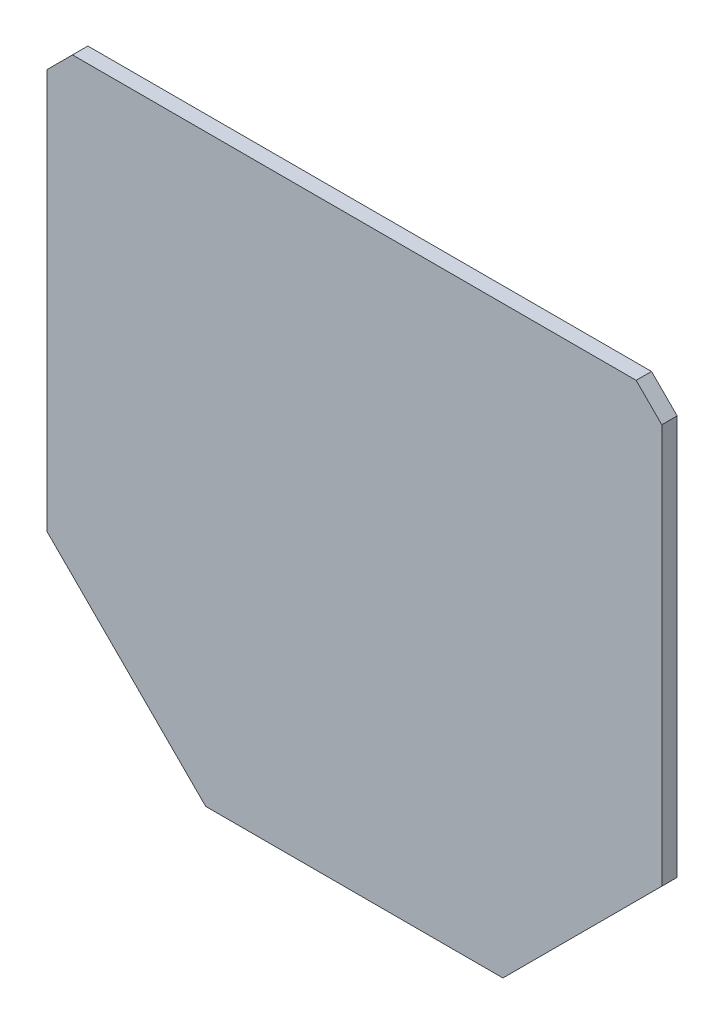
ISO-10303-21;
HEADER;
FILE_DESCRIPTION(('STEP AP214'),'2;1');
FILE_NAME('part.step','',(''),(''),'','','');
FILE_SCHEMA(('AUTOMOTIVE_DESIGN { 1 0 10303 214 1 1 1 1 }'));
ENDSEC;
DATA;
#1=APPLICATION_CONTEXT('core data for automotive mechanical design processes');
#2=APPLICATION_PROTOCOL_DEFINITION('international standard','automotive_design',2000,#1);
#3=PRODUCT_CONTEXT('',#1,'mechanical');
#4=PRODUCT('Part','Part','',(#3));
#5=PRODUCT_RELATED_PRODUCT_CATEGORY('part','',(#4));
#6=PRODUCT_DEFINITION_FORMATION('','',#4);
#7=PRODUCT_DEFINITION_CONTEXT('part definition',#1,'design');
#8=PRODUCT_DEFINITION('design','',#6,#7);
#9=PRODUCT_DEFINITION_SHAPE('','',#8);
#10=(LENGTH_UNIT() NAMED_UNIT(*) SI_UNIT(.MILLI.,.METRE.));
#11=(NAMED_UNIT(*) PLANE_ANGLE_UNIT() SI_UNIT($,.RADIAN.));
#12=(NAMED_UNIT(*) SI_UNIT($,.STERADIAN.) SOLID_ANGLE_UNIT());
#13=UNCERTAINTY_MEASURE_WITH_UNIT(LENGTH_MEASURE(1.E-05),#10,'distance_accuracy_value','');
#14=(GEOMETRIC_REPRESENTATION_CONTEXT(3) GLOBAL_UNCERTAINTY_ASSIGNED_CONTEXT((#13)) GLOBAL_UNIT_ASSIGNED_CONTEXT((#10,
#11,#12)) REPRESENTATION_CONTEXT('',''));
#15=CARTESIAN_POINT('',(0.,0.,0.));
#16=DIRECTION('',(0.,0.,1.));
#17=DIRECTION('',(1.,0.,0.));
#18=AXIS2_PLACEMENT_3D('',#15,#16,#17);
#19=CARTESIAN_POINT('',(0.,22.,1.5));
#20=DIRECTION('',(0.,-1.,0.));
#21=DIRECTION('',(0.,0.,-1.));
#22=AXIS2_PLACEMENT_3D('',#19,#20,#21);
#23=PLANE('',#22);
#24=DIRECTION('',(-1.,0.,0.));
#25=VECTOR('',#24,1.);
#26=CARTESIAN_POINT('',(0.,22.,0.));
#27=LINE('',#26,#25);
#28=CARTESIAN_POINT('',(27.4974746830583,22.,0.));
#29=VERTEX_POINT('',#28);
#30=CARTESIAN_POINT('',(-27.4974746830583,22.,0.));
#31=VERTEX_POINT('',#30);
#32=EDGE_CURVE('E133',#29,#31,#27,.T.);
#33=ORIENTED_EDGE('',*,*,#32,.T.);
#34=DIRECTION('',(0.,0.,-1.));
#35=VECTOR('',#34,1.);
#36=CARTESIAN_POINT('',(-27.4974746830583,22.,1.5));
#37=LINE('',#36,#35);
#38=CARTESIAN_POINT('',(-27.4974746830583,22.,1.5));
#39=VERTEX_POINT('',#38);
#40=EDGE_CURVE('E11',#39,#31,#37,.T.);
#41=ORIENTED_EDGE('',*,*,#40,.F.);
#42=DIRECTION('',(-1.,0.,0.));
#43=VECTOR('',#42,1.);
#44=CARTESIAN_POINT('',(0.,22.,1.5));
#45=LINE('',#44,#43);
#46=CARTESIAN_POINT('',(27.4974746830583,22.,1.5));
#47=VERTEX_POINT('',#46);
#48=EDGE_CURVE('E152',#47,#39,#45,.T.);
#49=ORIENTED_EDGE('',*,*,#48,.F.);
#50=DIRECTION('',(0.,0.,-1.));
#51=VECTOR('',#50,1.);
#52=CARTESIAN_POINT('',(27.4974746830583,22.,1.5));
#53=LINE('',#52,#51);
#54=EDGE_CURVE('E129',#47,#29,#53,.T.);
#55=ORIENTED_EDGE('',*,*,#54,.T.);
#56=EDGE_LOOP('',(#33,#41,#49,#55));
#57=FACE_BOUND('',#56,.T.);
#58=ADVANCED_FACE('F39',(#57),#23,.F.);
#59=CARTESIAN_POINT('',(-24.7487373415291,24.7487373415292,1.5));
#60=DIRECTION('',(0.707106781186547,-0.707106781186548,0.));
#61=DIRECTION('',(0.707106781186548,0.707106781186547,0.));
#62=AXIS2_PLACEMENT_3D('',#59,#60,#61);
#63=PLANE('',#62);
#64=DIRECTION('',(-0.707106781186548,-0.707106781186547,0.));
#65=VECTOR('',#64,1.);
#66=CARTESIAN_POINT('',(-24.7487373415291,24.7487373415292,0.));
#67=LINE('',#66,#65);
#68=CARTESIAN_POINT('',(-30.,19.4974746830583,0.));
#69=VERTEX_POINT('',#68);
#70=EDGE_CURVE('E136',#31,#69,#67,.T.);
#71=ORIENTED_EDGE('',*,*,#70,.T.);
#72=DIRECTION('',(0.,0.,-1.));
#73=VECTOR('',#72,1.);
#74=CARTESIAN_POINT('',(-30.,19.4974746830583,1.5));
#75=LINE('',#74,#73);
#76=CARTESIAN_POINT('',(-30.,19.4974746830583,1.5));
#77=VERTEX_POINT('',#76);
#78=EDGE_CURVE('E47',#77,#69,#75,.T.);
#79=ORIENTED_EDGE('',*,*,#78,.F.);
#80=DIRECTION('',(-0.707106781186548,-0.707106781186547,0.));
#81=VECTOR('',#80,1.);
#82=CARTESIAN_POINT('',(-24.7487373415291,24.7487373415292,1.5));
#83=LINE('',#82,#81);
#84=EDGE_CURVE('E94',#39,#77,#83,.T.);
#85=ORIENTED_EDGE('',*,*,#84,.F.);
#86=ORIENTED_EDGE('',*,*,#40,.T.);
#87=EDGE_LOOP('',(#71,#79,#85,#86));
#88=FACE_BOUND('',#87,.T.);
#89=ADVANCED_FACE('F165',(#88),#63,.F.);
#90=CARTESIAN_POINT('',(-30.,0.,1.5));
#91=DIRECTION('',(-1.,0.,0.));
#92=DIRECTION('',(0.,0.,1.));
#93=AXIS2_PLACEMENT_3D('',#90,#91,#92);
#94=PLANE('',#93);
#95=DIRECTION('',(0.,1.,0.));
#96=VECTOR('',#95,1.);
#97=CARTESIAN_POINT('',(-30.,0.,0.));
#98=LINE('',#97,#96);
#99=CARTESIAN_POINT('',(-30.,-19.4974746830584,0.));
#100=VERTEX_POINT('',#99);
#101=EDGE_CURVE('E139',#100,#69,#98,.T.);
#102=ORIENTED_EDGE('',*,*,#101,.F.);
#103=DIRECTION('',(0.,0.,-1.));
#104=VECTOR('',#103,1.);
#105=CARTESIAN_POINT('',(-30.,-19.4974746830584,1.5));
#106=LINE('',#105,#104);
#107=CARTESIAN_POINT('',(-30.,-19.4974746830584,1.5));
#108=VERTEX_POINT('',#107);
#109=EDGE_CURVE('E158',#108,#100,#106,.T.);
#110=ORIENTED_EDGE('',*,*,#109,.F.);
#111=DIRECTION('',(0.,1.,0.));
#112=VECTOR('',#111,1.);
#113=CARTESIAN_POINT('',(-30.,0.,1.5));
#114=LINE('',#113,#112);
#115=EDGE_CURVE('E164',#108,#77,#114,.T.);
#116=ORIENTED_EDGE('',*,*,#115,.T.);
#117=ORIENTED_EDGE('',*,*,#78,.T.);
#118=EDGE_LOOP('',(#102,#110,#116,#117));
#119=FACE_BOUND('',#118,.T.);
#120=ADVANCED_FACE('F162',(#119),#94,.T.);
#121=CARTESIAN_POINT('',(-24.7487373415291,-24.7487373415292,1.5));
#122=DIRECTION('',(0.707106781186546,0.707106781186548,0.));
#123=DIRECTION('',(-0.707106781186549,0.707106781186546,0.));
#124=AXIS2_PLACEMENT_3D('',#121,#122,#123);
#125=PLANE('',#124);
#126=DIRECTION('',(0.707106781186549,-0.707106781186546,0.));
#127=VECTOR('',#126,1.);
#128=CARTESIAN_POINT('',(-24.7487373415291,-24.7487373415292,0.));
#129=LINE('',#128,#127);
#130=CARTESIAN_POINT('',(-14.4974746830583,-35.,0.));
#131=VERTEX_POINT('',#130);
#132=EDGE_CURVE('E142',#100,#131,#129,.T.);
#133=ORIENTED_EDGE('',*,*,#132,.T.);
#134=DIRECTION('',(0.,0.,-1.));
#135=VECTOR('',#134,1.);
#136=CARTESIAN_POINT('',(-14.4974746830583,-35.,1.5));
#137=LINE('',#136,#135);
#138=CARTESIAN_POINT('',(-14.4974746830583,-35.,1.5));
#139=VERTEX_POINT('',#138);
#140=EDGE_CURVE('E156',#139,#131,#137,.T.);
#141=ORIENTED_EDGE('',*,*,#140,.F.);
#142=DIRECTION('',(0.707106781186549,-0.707106781186546,0.));
#143=VECTOR('',#142,1.);
#144=CARTESIAN_POINT('',(-24.7487373415291,-24.7487373415292,1.5));
#145=LINE('',#144,#143);
#146=EDGE_CURVE('E176',#108,#139,#145,.T.);
#147=ORIENTED_EDGE('',*,*,#146,.F.);
#148=ORIENTED_EDGE('',*,*,#109,.T.);
#149=EDGE_LOOP('',(#133,#141,#147,#148));
#150=FACE_BOUND('',#149,.T.);
#151=ADVANCED_FACE('F174',(#150),#125,.F.);
#152=CARTESIAN_POINT('',(0.,-35.,1.5));
#153=DIRECTION('',(0.,-1.,0.));
#154=DIRECTION('',(1.,0.,0.));
#155=AXIS2_PLACEMENT_3D('',#152,#153,#154);
#156=PLANE('',#155);
#157=DIRECTION('',(-1.,0.,0.));
#158=VECTOR('',#157,1.);
#159=CARTESIAN_POINT('',(0.,-35.,0.));
#160=LINE('',#159,#158);
#161=CARTESIAN_POINT('',(14.4974746830583,-35.,0.));
#162=VERTEX_POINT('',#161);
#163=EDGE_CURVE('E145',#162,#131,#160,.T.);
#164=ORIENTED_EDGE('',*,*,#163,.F.);
#165=DIRECTION('',(0.,0.,-1.));
#166=VECTOR('',#165,1.);
#167=CARTESIAN_POINT('',(14.4974746830583,-35.,1.5));
#168=LINE('',#167,#166);
#169=CARTESIAN_POINT('',(14.4974746830583,-35.,1.5));
#170=VERTEX_POINT('',#169);
#171=EDGE_CURVE('E119',#170,#162,#168,.T.);
#172=ORIENTED_EDGE('',*,*,#171,.F.);
#173=DIRECTION('',(-1.,0.,0.));
#174=VECTOR('',#173,1.);
#175=CARTESIAN_POINT('',(0.,-35.,1.5));
#176=LINE('',#175,#174);
#177=EDGE_CURVE('E125',#170,#139,#176,.T.);
#178=ORIENTED_EDGE('',*,*,#177,.T.);
#179=ORIENTED_EDGE('',*,*,#140,.T.);
#180=EDGE_LOOP('',(#164,#172,#178,#179));
#181=FACE_BOUND('',#180,.T.);
#182=ADVANCED_FACE('F182',(#181),#156,.T.);
#183=CARTESIAN_POINT('',(24.7487373415292,-24.7487373415292,1.5));
#184=DIRECTION('',(0.707106781186547,-0.707106781186548,0.));
#185=DIRECTION('',(0.707106781186548,0.707106781186547,0.));
#186=AXIS2_PLACEMENT_3D('',#183,#184,#185);
#187=PLANE('',#186);
#188=DIRECTION('',(-0.707106781186548,-0.707106781186547,0.));
#189=VECTOR('',#188,1.);
#190=CARTESIAN_POINT('',(24.7487373415292,-24.7487373415292,0.));
#191=LINE('',#190,#189);
#192=CARTESIAN_POINT('',(30.,-19.4974746830584,0.));
#193=VERTEX_POINT('',#192);
#194=EDGE_CURVE('E114',#193,#162,#191,.T.);
#195=ORIENTED_EDGE('',*,*,#194,.F.);
#196=DIRECTION('',(0.,0.,-1.));
#197=VECTOR('',#196,1.);
#198=CARTESIAN_POINT('',(30.,-19.4974746830584,1.5));
#199=LINE('',#198,#197);
#200=CARTESIAN_POINT('',(30.,-19.4974746830584,1.5));
#201=VERTEX_POINT('',#200);
#202=EDGE_CURVE('E109',#201,#193,#199,.T.);
#203=ORIENTED_EDGE('',*,*,#202,.F.);
#204=DIRECTION('',(-0.707106781186548,-0.707106781186547,0.));
#205=VECTOR('',#204,1.);
#206=CARTESIAN_POINT('',(24.7487373415292,-24.7487373415292,1.5));
#207=LINE('',#206,#205);
#208=EDGE_CURVE('E112',#201,#170,#207,.T.);
#209=ORIENTED_EDGE('',*,*,#208,.T.);
#210=ORIENTED_EDGE('',*,*,#171,.T.);
#211=EDGE_LOOP('',(#195,#203,#209,#210));
#212=FACE_BOUND('',#211,.T.);
#213=ADVANCED_FACE('F111',(#212),#187,.T.);
#214=CARTESIAN_POINT('',(30.,0.,1.5));
#215=DIRECTION('',(1.,0.,0.));
#216=DIRECTION('',(0.,0.,-1.));
#217=AXIS2_PLACEMENT_3D('',#214,#215,#216);
#218=PLANE('',#217);
#219=DIRECTION('',(0.,-1.,0.));
#220=VECTOR('',#219,1.);
#221=CARTESIAN_POINT('',(30.,0.,0.));
#222=LINE('',#221,#220);
#223=CARTESIAN_POINT('',(30.,19.4974746830583,0.));
#224=VERTEX_POINT('',#223);
#225=EDGE_CURVE('E149',#224,#193,#222,.T.);
#226=ORIENTED_EDGE('',*,*,#225,.F.);
#227=DIRECTION('',(0.,0.,-1.));
#228=VECTOR('',#227,1.);
#229=CARTESIAN_POINT('',(30.,19.4974746830583,1.5));
#230=LINE('',#229,#228);
#231=CARTESIAN_POINT('',(30.,19.4974746830583,1.5));
#232=VERTEX_POINT('',#231);
#233=EDGE_CURVE('E83',#232,#224,#230,.T.);
#234=ORIENTED_EDGE('',*,*,#233,.F.);
#235=DIRECTION('',(0.,-1.,0.));
#236=VECTOR('',#235,1.);
#237=CARTESIAN_POINT('',(30.,0.,1.5));
#238=LINE('',#237,#236);
#239=EDGE_CURVE('E123',#232,#201,#238,.T.);
#240=ORIENTED_EDGE('',*,*,#239,.T.);
#241=ORIENTED_EDGE('',*,*,#202,.T.);
#242=EDGE_LOOP('',(#226,#234,#240,#241));
#243=FACE_BOUND('',#242,.T.);
#244=ADVANCED_FACE('F127',(#243),#218,.T.);
#245=CARTESIAN_POINT('',(24.7487373415291,24.7487373415292,1.5));
#246=DIRECTION('',(-0.707106781186547,-0.707106781186548,0.));
#247=DIRECTION('',(0.707106781186548,-0.707106781186547,0.));
#248=AXIS2_PLACEMENT_3D('',#245,#246,#247);
#249=PLANE('',#248);
#250=DIRECTION('',(-0.707106781186548,0.707106781186547,0.));
#251=VECTOR('',#250,1.);
#252=CARTESIAN_POINT('',(24.7487373415291,24.7487373415292,0.));
#253=LINE('',#252,#251);
#254=EDGE_CURVE('E86',#224,#29,#253,.T.);
#255=ORIENTED_EDGE('',*,*,#254,.T.);
#256=ORIENTED_EDGE('',*,*,#54,.F.);
#257=DIRECTION('',(-0.707106781186548,0.707106781186547,0.));
#258=VECTOR('',#257,1.);
#259=CARTESIAN_POINT('',(24.7487373415291,24.7487373415292,1.5));
#260=LINE('',#259,#258);
#261=EDGE_CURVE('E55',#232,#47,#260,.T.);
#262=ORIENTED_EDGE('',*,*,#261,.F.);
#263=ORIENTED_EDGE('',*,*,#233,.T.);
#264=EDGE_LOOP('',(#255,#256,#262,#263));
#265=FACE_BOUND('',#264,.T.);
#266=ADVANCED_FACE('F185',(#265),#249,.F.);
#267=CARTESIAN_POINT('',(0.,0.,1.5));
#268=DIRECTION('',(0.,0.,1.));
#269=DIRECTION('',(1.,0.,0.));
#270=AXIS2_PLACEMENT_3D('',#267,#268,#269);
#271=PLANE('',#270);
#272=ORIENTED_EDGE('',*,*,#48,.T.);
#273=ORIENTED_EDGE('',*,*,#84,.T.);
#274=ORIENTED_EDGE('',*,*,#115,.F.);
#275=ORIENTED_EDGE('',*,*,#146,.T.);
#276=ORIENTED_EDGE('',*,*,#177,.F.);
#277=ORIENTED_EDGE('',*,*,#208,.F.);
#278=ORIENTED_EDGE('',*,*,#239,.F.);
#279=ORIENTED_EDGE('',*,*,#261,.T.);
#280=EDGE_LOOP('',(#272,#273,#274,#275,#276,#277,#278,#279));
#281=FACE_BOUND('',#280,.T.);
#282=ADVANCED_FACE('F122',(#281),#271,.T.);
#283=CARTESIAN_POINT('',(0.,0.,0.));
#284=DIRECTION('',(0.,0.,1.));
#285=DIRECTION('',(1.,0.,0.));
#286=AXIS2_PLACEMENT_3D('',#283,#284,#285);
#287=PLANE('',#286);
#288=ORIENTED_EDGE('',*,*,#32,.F.);
#289=ORIENTED_EDGE('',*,*,#254,.F.);
#290=ORIENTED_EDGE('',*,*,#225,.T.);
#291=ORIENTED_EDGE('',*,*,#194,.T.);
#292=ORIENTED_EDGE('',*,*,#163,.T.);
#293=ORIENTED_EDGE('',*,*,#132,.F.);
#294=ORIENTED_EDGE('',*,*,#101,.T.);
#295=ORIENTED_EDGE('',*,*,#70,.F.);
#296=EDGE_LOOP('',(#288,#289,#290,#291,#292,#293,#294,#295));
#297=FACE_BOUND('',#296,.T.);
#298=ADVANCED_FACE('F170',(#297),#287,.F.);
#299=CLOSED_SHELL('',(#58,#89,#120,#151,#182,#213,#244,#266,#282,#298));
#300=MANIFOLD_SOLID_BREP('B2',#299);
#301=ADVANCED_BREP_SHAPE_REPRESENTATION('',(#18,#300),#14);
#302=SHAPE_DEFINITION_REPRESENTATION(#9,#301);
ENDSEC;
END-ISO-10303-21;
